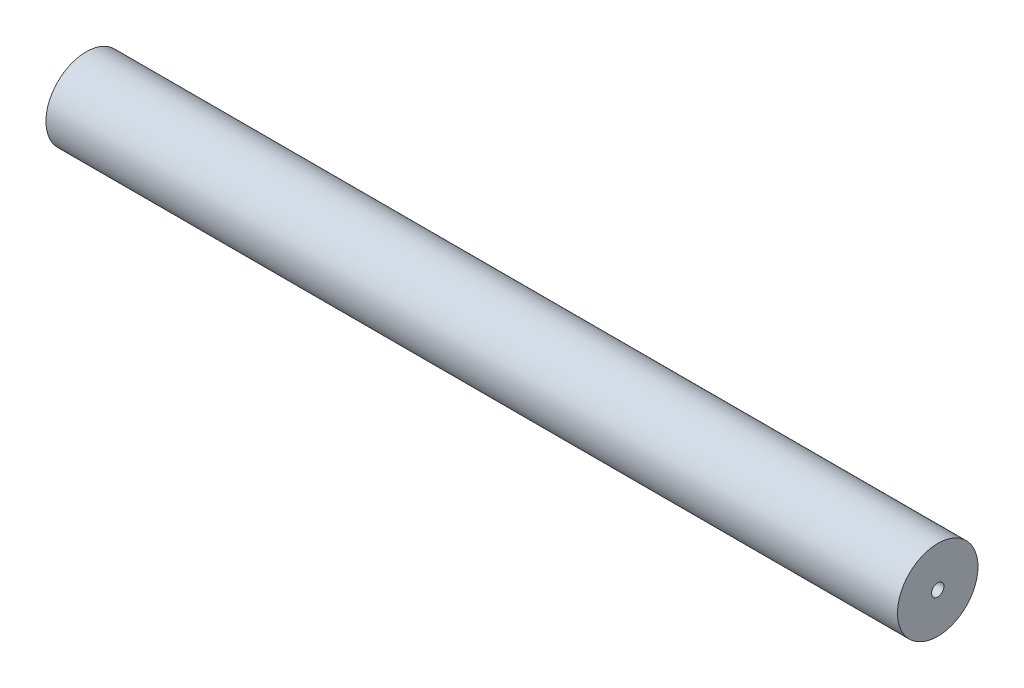
ISO-10303-21;
HEADER;
FILE_DESCRIPTION(('STEP AP214'),'2;1');
FILE_NAME('part.step','',(''),(''),'','','');
FILE_SCHEMA(('AUTOMOTIVE_DESIGN { 1 0 10303 214 1 1 1 1 }'));
ENDSEC;
DATA;
#1=APPLICATION_CONTEXT('core data for automotive mechanical design processes');
#2=APPLICATION_PROTOCOL_DEFINITION('international standard','automotive_design',2000,#1);
#3=PRODUCT_CONTEXT('',#1,'mechanical');
#4=PRODUCT('Part','Part','',(#3));
#5=PRODUCT_RELATED_PRODUCT_CATEGORY('part','',(#4));
#6=PRODUCT_DEFINITION_FORMATION('','',#4);
#7=PRODUCT_DEFINITION_CONTEXT('part definition',#1,'design');
#8=PRODUCT_DEFINITION('design','',#6,#7);
#9=PRODUCT_DEFINITION_SHAPE('','',#8);
#10=(LENGTH_UNIT() NAMED_UNIT(*) SI_UNIT(.MILLI.,.METRE.));
#11=(NAMED_UNIT(*) PLANE_ANGLE_UNIT() SI_UNIT($,.RADIAN.));
#12=(NAMED_UNIT(*) SI_UNIT($,.STERADIAN.) SOLID_ANGLE_UNIT());
#13=UNCERTAINTY_MEASURE_WITH_UNIT(LENGTH_MEASURE(1.E-05),#10,'distance_accuracy_value','');
#14=(GEOMETRIC_REPRESENTATION_CONTEXT(3) GLOBAL_UNCERTAINTY_ASSIGNED_CONTEXT((#13)) GLOBAL_UNIT_ASSIGNED_CONTEXT((#10,
#11,#12)) REPRESENTATION_CONTEXT('',''));
#15=CARTESIAN_POINT('',(0.,0.,0.));
#16=DIRECTION('',(0.,0.,1.));
#17=DIRECTION('',(1.,0.,0.));
#18=AXIS2_PLACEMENT_3D('',#15,#16,#17);
#19=CARTESIAN_POINT('',(-57.75,3.24999999999999,0.));
#20=DIRECTION('',(-1.,0.,0.));
#21=DIRECTION('',(0.,0.,1.));
#22=AXIS2_PLACEMENT_3D('',#19,#20,#21);
#23=PLANE('',#22);
#24=CARTESIAN_POINT('',(-57.75,0.,0.));
#25=DIRECTION('',(1.,0.,0.));
#26=DIRECTION('',(0.,0.,-1.));
#27=AXIS2_PLACEMENT_3D('',#24,#25,#26);
#28=CIRCLE('',#27,2.24999999999999);
#29=CARTESIAN_POINT('',(-57.75,0.,-2.24999999999999));
#30=VERTEX_POINT('',#29);
#31=EDGE_CURVE('E80',#30,#30,#28,.T.);
#32=ORIENTED_EDGE('',*,*,#31,.T.);
#33=EDGE_LOOP('',(#32));
#34=FACE_BOUND('',#33,.T.);
#35=CARTESIAN_POINT('',(-57.75,0.,0.));
#36=DIRECTION('',(1.,0.,0.));
#37=DIRECTION('',(0.,0.,-1.));
#38=AXIS2_PLACEMENT_3D('',#35,#36,#37);
#39=CIRCLE('',#38,3.24999999999999);
#40=CARTESIAN_POINT('',(-57.75,0.,-3.24999999999999));
#41=VERTEX_POINT('',#40);
#42=EDGE_CURVE('E12',#41,#41,#39,.T.);
#43=ORIENTED_EDGE('',*,*,#42,.F.);
#44=EDGE_LOOP('',(#43));
#45=FACE_BOUND('',#44,.T.);
#46=ADVANCED_FACE('F51',(#34,#45),#23,.T.);
#47=CARTESIAN_POINT('',(13.5,0.,0.));
#48=DIRECTION('',(1.,0.,0.));
#49=DIRECTION('',(0.,0.,-1.));
#50=AXIS2_PLACEMENT_3D('',#47,#48,#49);
#51=CYLINDRICAL_SURFACE('',#50,3.24999999999999);
#52=ORIENTED_EDGE('',*,*,#42,.T.);
#53=EDGE_LOOP('',(#52));
#54=FACE_BOUND('',#53,.T.);
#55=CARTESIAN_POINT('',(11.,0.,0.));
#56=DIRECTION('',(1.,0.,0.));
#57=DIRECTION('',(0.,0.,-1.));
#58=AXIS2_PLACEMENT_3D('',#55,#56,#57);
#59=CIRCLE('',#58,3.25);
#60=CARTESIAN_POINT('',(11.,0.,-3.25));
#61=VERTEX_POINT('',#60);
#62=EDGE_CURVE('E58',#61,#61,#59,.T.);
#63=ORIENTED_EDGE('',*,*,#62,.F.);
#64=EDGE_LOOP('',(#63));
#65=FACE_BOUND('',#64,.T.);
#66=ADVANCED_FACE('F100',(#54,#65),#51,.T.);
#67=CARTESIAN_POINT('',(11.,0.499999999999998,0.));
#68=DIRECTION('',(1.,0.,0.));
#69=DIRECTION('',(0.,0.,-1.));
#70=AXIS2_PLACEMENT_3D('',#67,#68,#69);
#71=PLANE('',#70);
#72=ORIENTED_EDGE('',*,*,#62,.T.);
#73=EDGE_LOOP('',(#72));
#74=FACE_BOUND('',#73,.T.);
#75=CARTESIAN_POINT('',(11.,0.,0.));
#76=DIRECTION('',(1.,0.,0.));
#77=DIRECTION('',(0.,0.,-1.));
#78=AXIS2_PLACEMENT_3D('',#75,#76,#77);
#79=CIRCLE('',#78,0.499999999999998);
#80=CARTESIAN_POINT('',(11.,0.,-0.499999999999998));
#81=VERTEX_POINT('',#80);
#82=EDGE_CURVE('E64',#81,#81,#79,.T.);
#83=ORIENTED_EDGE('',*,*,#82,.F.);
#84=EDGE_LOOP('',(#83));
#85=FACE_BOUND('',#84,.T.);
#86=ADVANCED_FACE('F104',(#74,#85),#71,.T.);
#87=CARTESIAN_POINT('',(13.5,0.,0.));
#88=DIRECTION('',(1.,0.,0.));
#89=DIRECTION('',(0.,0.,-1.));
#90=AXIS2_PLACEMENT_3D('',#87,#88,#89);
#91=CYLINDRICAL_SURFACE('',#90,0.499999999999998);
#92=ORIENTED_EDGE('',*,*,#82,.T.);
#93=EDGE_LOOP('',(#92));
#94=FACE_BOUND('',#93,.T.);
#95=CARTESIAN_POINT('',(10.,0.,0.));
#96=DIRECTION('',(1.,0.,0.));
#97=DIRECTION('',(0.,0.,-1.));
#98=AXIS2_PLACEMENT_3D('',#95,#96,#97);
#99=CIRCLE('',#98,0.499999999999998);
#100=CARTESIAN_POINT('',(10.,0.,-0.499999999999998));
#101=VERTEX_POINT('',#100);
#102=EDGE_CURVE('E70',#101,#101,#99,.T.);
#103=ORIENTED_EDGE('',*,*,#102,.F.);
#104=EDGE_LOOP('',(#103));
#105=FACE_BOUND('',#104,.T.);
#106=ADVANCED_FACE('F96',(#94,#105),#91,.F.);
#107=CARTESIAN_POINT('',(10.,0.499999999999998,0.));
#108=DIRECTION('',(-1.,0.,0.));
#109=DIRECTION('',(0.,0.,1.));
#110=AXIS2_PLACEMENT_3D('',#107,#108,#109);
#111=PLANE('',#110);
#112=ORIENTED_EDGE('',*,*,#102,.T.);
#113=EDGE_LOOP('',(#112));
#114=FACE_BOUND('',#113,.T.);
#115=CARTESIAN_POINT('',(10.,0.,0.));
#116=DIRECTION('',(1.,0.,0.));
#117=DIRECTION('',(0.,0.,-1.));
#118=AXIS2_PLACEMENT_3D('',#115,#116,#117);
#119=CIRCLE('',#118,2.25);
#120=CARTESIAN_POINT('',(10.,0.,-2.25));
#121=VERTEX_POINT('',#120);
#122=EDGE_CURVE('E76',#121,#121,#119,.T.);
#123=ORIENTED_EDGE('',*,*,#122,.F.);
#124=EDGE_LOOP('',(#123));
#125=FACE_BOUND('',#124,.T.);
#126=ADVANCED_FACE('F90',(#114,#125),#111,.T.);
#127=CARTESIAN_POINT('',(13.5,0.,0.));
#128=DIRECTION('',(1.,0.,0.));
#129=DIRECTION('',(0.,0.,-1.));
#130=AXIS2_PLACEMENT_3D('',#127,#128,#129);
#131=CYLINDRICAL_SURFACE('',#130,2.24999999999999);
#132=ORIENTED_EDGE('',*,*,#122,.T.);
#133=EDGE_LOOP('',(#132));
#134=FACE_BOUND('',#133,.T.);
#135=ORIENTED_EDGE('',*,*,#31,.F.);
#136=EDGE_LOOP('',(#135));
#137=FACE_BOUND('',#136,.T.);
#138=ADVANCED_FACE('F88',(#134,#137),#131,.F.);
#139=CLOSED_SHELL('',(#46,#66,#86,#106,#126,#138));
#140=MANIFOLD_SOLID_BREP('B2',#139);
#141=ADVANCED_BREP_SHAPE_REPRESENTATION('',(#18,#140),#14);
#142=SHAPE_DEFINITION_REPRESENTATION(#9,#141);
ENDSEC;
END-ISO-10303-21;
